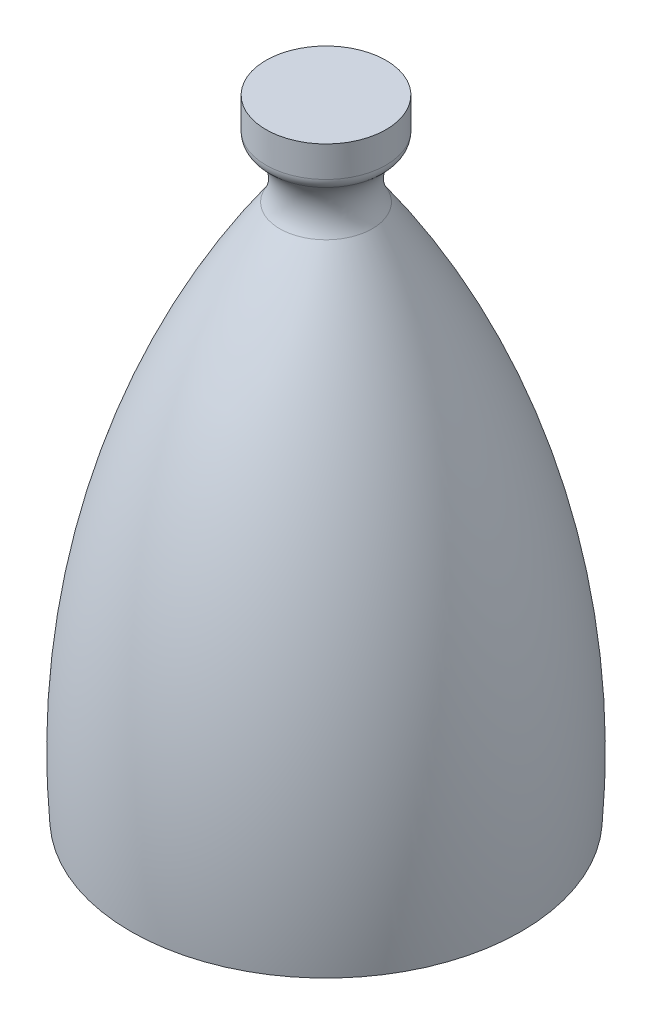
ISO-10303-21;
HEADER;
FILE_DESCRIPTION(('STEP AP214'),'2;1');
FILE_NAME('part.step','',(''),(''),'','','');
FILE_SCHEMA(('AUTOMOTIVE_DESIGN { 1 0 10303 214 1 1 1 1 }'));
ENDSEC;
DATA;
#1=APPLICATION_CONTEXT('core data for automotive mechanical design processes');
#2=APPLICATION_PROTOCOL_DEFINITION('international standard','automotive_design',2000,#1);
#3=PRODUCT_CONTEXT('',#1,'mechanical');
#4=PRODUCT('Part','Part','',(#3));
#5=PRODUCT_RELATED_PRODUCT_CATEGORY('part','',(#4));
#6=PRODUCT_DEFINITION_FORMATION('','',#4);
#7=PRODUCT_DEFINITION_CONTEXT('part definition',#1,'design');
#8=PRODUCT_DEFINITION('design','',#6,#7);
#9=PRODUCT_DEFINITION_SHAPE('','',#8);
#10=(LENGTH_UNIT() NAMED_UNIT(*) SI_UNIT(.MILLI.,.METRE.));
#11=(NAMED_UNIT(*) PLANE_ANGLE_UNIT() SI_UNIT($,.RADIAN.));
#12=(NAMED_UNIT(*) SI_UNIT($,.STERADIAN.) SOLID_ANGLE_UNIT());
#13=UNCERTAINTY_MEASURE_WITH_UNIT(LENGTH_MEASURE(1.E-05),#10,'distance_accuracy_value','');
#14=(GEOMETRIC_REPRESENTATION_CONTEXT(3) GLOBAL_UNCERTAINTY_ASSIGNED_CONTEXT((#13)) GLOBAL_UNIT_ASSIGNED_CONTEXT((#10,
#11,#12)) REPRESENTATION_CONTEXT('',''));
#15=CARTESIAN_POINT('',(0.,0.,0.));
#16=DIRECTION('',(0.,0.,1.));
#17=DIRECTION('',(1.,0.,0.));
#18=AXIS2_PLACEMENT_3D('',#15,#16,#17);
#19=CARTESIAN_POINT('',(71.7029063234353,607.968222433962,0.));
#20=DIRECTION('',(0.,-1.,0.));
#21=DIRECTION('',(0.,0.,-1.));
#22=AXIS2_PLACEMENT_3D('',#19,#20,#21);
#23=DEGENERATE_TOROIDAL_SURFACE('',#22,461.628008582917,607.914040992927,.F.);
#24=CARTESIAN_POINT('',(71.7029063234354,959.585843719148,0.));
#25=DIRECTION('',(0.,-1.,0.));
#26=DIRECTION('',(0.,0.,-1.));
#27=AXIS2_PLACEMENT_3D('',#24,#25,#26);
#28=CIRCLE('',#27,34.2797748184903);
#29=CARTESIAN_POINT('',(71.7029063234354,959.585843719148,-34.2797748184903));
#30=VERTEX_POINT('',#29);
#31=EDGE_CURVE('E48',#30,#30,#28,.T.);
#32=ORIENTED_EDGE('',*,*,#31,.T.);
#33=EDGE_LOOP('',(#32));
#34=FACE_BOUND('',#33,.T.);
#35=CARTESIAN_POINT('',(71.7029063234354,564.083974186739,0.));
#36=DIRECTION('',(0.,-1.,0.));
#37=DIRECTION('',(0.,0.,-1.));
#38=AXIS2_PLACEMENT_3D('',#35,#36,#37);
#39=CIRCLE('',#38,144.7);
#40=CARTESIAN_POINT('',(71.7029063234354,564.083974186739,-144.7));
#41=VERTEX_POINT('',#40);
#42=EDGE_CURVE('E52',#41,#41,#39,.T.);
#43=ORIENTED_EDGE('',*,*,#42,.F.);
#44=EDGE_LOOP('',(#43));
#45=FACE_BOUND('',#44,.T.);
#46=ADVANCED_FACE('F37',(#34,#45),#23,.F.);
#47=CARTESIAN_POINT('',(71.7029063234354,974.87383025393,0.));
#48=DIRECTION('',(0.,-1.,0.));
#49=DIRECTION('',(0.,0.,-1.));
#50=AXIS2_PLACEMENT_3D('',#47,#48,#49);
#51=TOROIDAL_SURFACE('',#50,59.7597523764606,29.7145046844524);
#52=CARTESIAN_POINT('',(71.7029063234354,997.785941473113,0.));
#53=DIRECTION('',(0.,-1.,0.));
#54=DIRECTION('',(0.,0.,-1.));
#55=AXIS2_PLACEMENT_3D('',#52,#53,#54);
#56=CIRCLE('',#55,40.8392093577704);
#57=CARTESIAN_POINT('',(71.7029063234354,997.785941473113,-40.8392093577704));
#58=VERTEX_POINT('',#57);
#59=EDGE_CURVE('E44',#58,#58,#56,.T.);
#60=ORIENTED_EDGE('',*,*,#59,.T.);
#61=EDGE_LOOP('',(#60));
#62=FACE_BOUND('',#61,.T.);
#63=ORIENTED_EDGE('',*,*,#31,.F.);
#64=EDGE_LOOP('',(#63));
#65=FACE_BOUND('',#64,.T.);
#66=ADVANCED_FACE('F74',(#62,#65),#51,.F.);
#67=CARTESIAN_POINT('',(0.,564.083974186739,0.));
#68=DIRECTION('',(0.,-1.,0.));
#69=DIRECTION('',(0.,0.,-1.));
#70=AXIS2_PLACEMENT_3D('',#67,#68,#69);
#71=PLANE('',#70);
#72=ORIENTED_EDGE('',*,*,#42,.T.);
#73=EDGE_LOOP('',(#72));
#74=FACE_BOUND('',#73,.T.);
#75=ADVANCED_FACE('F71',(#74),#71,.T.);
#76=CARTESIAN_POINT('',(71.7029063234354,564.083974186739,0.));
#77=DIRECTION('',(0.,-1.,0.));
#78=DIRECTION('',(0.,0.,-1.));
#79=AXIS2_PLACEMENT_3D('',#76,#77,#78);
#80=CYLINDRICAL_SURFACE('',#79,44.4717658416783);
#81=CARTESIAN_POINT('',(71.7029063234354,1005.49669131145,0.));
#82=DIRECTION('',(0.,1.,0.));
#83=DIRECTION('',(0.,0.,1.));
#84=AXIS2_PLACEMENT_3D('',#81,#82,#83);
#85=CIRCLE('',#84,44.4717658416783);
#86=CARTESIAN_POINT('',(71.7029063234354,1005.49669131145,44.4717658416783));
#87=VERTEX_POINT('',#86);
#88=EDGE_CURVE('E10',#87,#87,#85,.T.);
#89=ORIENTED_EDGE('',*,*,#88,.T.);
#90=EDGE_LOOP('',(#89));
#91=FACE_BOUND('',#90,.T.);
#92=CARTESIAN_POINT('',(71.7029063234354,1028.27997418674,0.));
#93=DIRECTION('',(0.,-1.,0.));
#94=DIRECTION('',(0.,0.,-1.));
#95=AXIS2_PLACEMENT_3D('',#92,#93,#94);
#96=CIRCLE('',#95,44.4717658416783);
#97=CARTESIAN_POINT('',(71.7029063234354,1028.27997418674,-44.4717658416783));
#98=VERTEX_POINT('',#97);
#99=EDGE_CURVE('E57',#98,#98,#96,.T.);
#100=ORIENTED_EDGE('',*,*,#99,.T.);
#101=EDGE_LOOP('',(#100));
#102=FACE_BOUND('',#101,.T.);
#103=ADVANCED_FACE('F61',(#91,#102),#80,.T.);
#104=CARTESIAN_POINT('',(0.,1028.27997418674,0.));
#105=DIRECTION('',(0.,-1.,0.));
#106=DIRECTION('',(0.,0.,-1.));
#107=AXIS2_PLACEMENT_3D('',#104,#105,#106);
#108=PLANE('',#107);
#109=ORIENTED_EDGE('',*,*,#99,.F.);
#110=EDGE_LOOP('',(#109));
#111=FACE_BOUND('',#110,.T.);
#112=ADVANCED_FACE('F63',(#111),#108,.F.);
#113=CARTESIAN_POINT('',(71.7029063234354,1005.49669131145,0.));
#114=DIRECTION('',(0.,1.,0.));
#115=DIRECTION('',(0.,0.,1.));
#116=AXIS2_PLACEMENT_3D('',#113,#114,#115);
#117=TOROIDAL_SURFACE('',#116,34.4717658416784,10.);
#118=ORIENTED_EDGE('',*,*,#88,.F.);
#119=EDGE_LOOP('',(#118));
#120=FACE_BOUND('',#119,.T.);
#121=ORIENTED_EDGE('',*,*,#59,.F.);
#122=EDGE_LOOP('',(#121));
#123=FACE_BOUND('',#122,.T.);
#124=ADVANCED_FACE('F39',(#120,#123),#117,.T.);
#125=CLOSED_SHELL('',(#46,#66,#75,#103,#112,#124));
#126=MANIFOLD_SOLID_BREP('B2',#125);
#127=ADVANCED_BREP_SHAPE_REPRESENTATION('',(#18,#126),#14);
#128=SHAPE_DEFINITION_REPRESENTATION(#9,#127);
ENDSEC;
END-ISO-10303-21;
